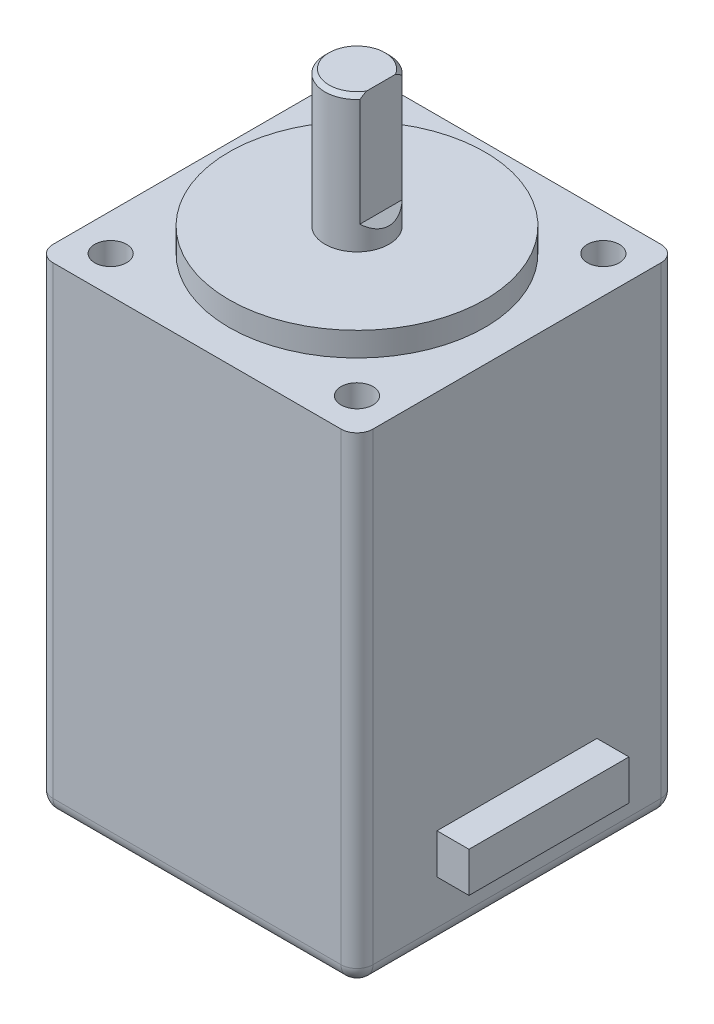
ISO-10303-21;
HEADER;
FILE_DESCRIPTION(('STEP AP214'),'2;1');
FILE_NAME('part.step','',(''),(''),'','','');
FILE_SCHEMA(('AUTOMOTIVE_DESIGN { 1 0 10303 214 1 1 1 1 }'));
ENDSEC;
DATA;
#1=APPLICATION_CONTEXT('core data for automotive mechanical design processes');
#2=APPLICATION_PROTOCOL_DEFINITION('international standard','automotive_design',2000,#1);
#3=PRODUCT_CONTEXT('',#1,'mechanical');
#4=PRODUCT('Part','Part','',(#3));
#5=PRODUCT_RELATED_PRODUCT_CATEGORY('part','',(#4));
#6=PRODUCT_DEFINITION_FORMATION('','',#4);
#7=PRODUCT_DEFINITION_CONTEXT('part definition',#1,'design');
#8=PRODUCT_DEFINITION('design','',#6,#7);
#9=PRODUCT_DEFINITION_SHAPE('','',#8);
#10=(LENGTH_UNIT() NAMED_UNIT(*) SI_UNIT(.MILLI.,.METRE.));
#11=(NAMED_UNIT(*) PLANE_ANGLE_UNIT() SI_UNIT($,.RADIAN.));
#12=(NAMED_UNIT(*) SI_UNIT($,.STERADIAN.) SOLID_ANGLE_UNIT());
#13=UNCERTAINTY_MEASURE_WITH_UNIT(LENGTH_MEASURE(1.E-05),#10,'distance_accuracy_value','');
#14=(GEOMETRIC_REPRESENTATION_CONTEXT(3) GLOBAL_UNCERTAINTY_ASSIGNED_CONTEXT((#13)) GLOBAL_UNIT_ASSIGNED_CONTEXT((#10,
#11,#12)) REPRESENTATION_CONTEXT('',''));
#15=CARTESIAN_POINT('',(0.,0.,0.));
#16=DIRECTION('',(0.,0.,1.));
#17=DIRECTION('',(1.,0.,0.));
#18=AXIS2_PLACEMENT_3D('',#15,#16,#17);
#19=CARTESIAN_POINT('',(9.99999999999998,-30.,9.99999999999995));
#20=DIRECTION('',(1.,0.,0.));
#21=DIRECTION('',(0.,0.,-1.));
#22=AXIS2_PLACEMENT_3D('',#19,#20,#21);
#23=PLANE('',#22);
#24=DIRECTION('',(0.,0.,-1.));
#25=VECTOR('',#24,1.);
#26=CARTESIAN_POINT('',(10.,-29.,-10.));
#27=LINE('',#26,#25);
#28=CARTESIAN_POINT('',(9.99999999999999,-29.,8.99999999999995));
#29=VERTEX_POINT('',#28);
#30=CARTESIAN_POINT('',(10.,-29.,-9.00000000000001));
#31=VERTEX_POINT('',#30);
#32=EDGE_CURVE('E746',#29,#31,#27,.T.);
#33=ORIENTED_EDGE('',*,*,#32,.T.);
#34=DIRECTION('',(0.,1.,0.));
#35=VECTOR('',#34,1.);
#36=CARTESIAN_POINT('',(10.,-30.,-9.00000000000001));
#37=LINE('',#36,#35);
#38=CARTESIAN_POINT('',(10.,0.,-9.00000000000001));
#39=VERTEX_POINT('',#38);
#40=EDGE_CURVE('E748',#31,#39,#37,.T.);
#41=ORIENTED_EDGE('',*,*,#40,.T.);
#42=DIRECTION('',(0.,0.,-1.));
#43=VECTOR('',#42,1.);
#44=CARTESIAN_POINT('',(9.99999999999998,0.,9.99999999999995));
#45=LINE('',#44,#43);
#46=CARTESIAN_POINT('',(9.99999999999999,0.,8.99999999999995));
#47=VERTEX_POINT('',#46);
#48=EDGE_CURVE('E235',#47,#39,#45,.T.);
#49=ORIENTED_EDGE('',*,*,#48,.F.);
#50=DIRECTION('',(0.,1.,0.));
#51=VECTOR('',#50,1.);
#52=CARTESIAN_POINT('',(9.99999999999999,-30.,8.99999999999995));
#53=LINE('',#52,#51);
#54=EDGE_CURVE('E744',#47,#29,#53,.F.);
#55=ORIENTED_EDGE('',*,*,#54,.T.);
#56=EDGE_LOOP('',(#33,#41,#49,#55));
#57=FACE_BOUND('',#56,.T.);
#58=DIRECTION('',(0.,0.,1.));
#59=VECTOR('',#58,1.);
#60=CARTESIAN_POINT('',(9.99999999999998,-26.25,9.99999999999995));
#61=LINE('',#60,#59);
#62=CARTESIAN_POINT('',(10.,-26.25,-5.));
#63=VERTEX_POINT('',#62);
#64=CARTESIAN_POINT('',(10.,-26.25,5.));
#65=VERTEX_POINT('',#64);
#66=EDGE_CURVE('E44',#63,#65,#61,.T.);
#67=ORIENTED_EDGE('',*,*,#66,.T.);
#68=DIRECTION('',(0.,1.,0.));
#69=VECTOR('',#68,1.);
#70=CARTESIAN_POINT('',(10.,-30.,5.));
#71=LINE('',#70,#69);
#72=CARTESIAN_POINT('',(10.,-23.75,5.));
#73=VERTEX_POINT('',#72);
#74=EDGE_CURVE('E12',#65,#73,#71,.T.);
#75=ORIENTED_EDGE('',*,*,#74,.T.);
#76=DIRECTION('',(0.,0.,-1.));
#77=VECTOR('',#76,1.);
#78=CARTESIAN_POINT('',(9.99999999999998,-23.75,9.99999999999996));
#79=LINE('',#78,#77);
#80=CARTESIAN_POINT('',(10.,-23.75,-5.));
#81=VERTEX_POINT('',#80);
#82=EDGE_CURVE('E371',#73,#81,#79,.T.);
#83=ORIENTED_EDGE('',*,*,#82,.T.);
#84=DIRECTION('',(0.,-1.,0.));
#85=VECTOR('',#84,1.);
#86=CARTESIAN_POINT('',(10.,-30.,-5.));
#87=LINE('',#86,#85);
#88=EDGE_CURVE('E160',#81,#63,#87,.T.);
#89=ORIENTED_EDGE('',*,*,#88,.T.);
#90=EDGE_LOOP('',(#67,#75,#83,#89));
#91=FACE_BOUND('',#90,.T.);
#92=ADVANCED_FACE('F36',(#57,#91),#23,.T.);
#93=CARTESIAN_POINT('',(-9.99999999999998,-30.,9.99999999999995));
#94=DIRECTION('',(-1.,0.,0.));
#95=DIRECTION('',(0.,0.,1.));
#96=AXIS2_PLACEMENT_3D('',#93,#94,#95);
#97=PLANE('',#96);
#98=DIRECTION('',(0.,0.,1.));
#99=VECTOR('',#98,1.);
#100=CARTESIAN_POINT('',(-9.99999999999998,0.,9.99999999999995));
#101=LINE('',#100,#99);
#102=CARTESIAN_POINT('',(-9.99999999999996,0.,-9.00000000000001));
#103=VERTEX_POINT('',#102);
#104=CARTESIAN_POINT('',(-9.99999999999998,0.,8.99999999999995));
#105=VERTEX_POINT('',#104);
#106=EDGE_CURVE('E227',#103,#105,#101,.T.);
#107=ORIENTED_EDGE('',*,*,#106,.F.);
#108=DIRECTION('',(0.,1.,0.));
#109=VECTOR('',#108,1.);
#110=CARTESIAN_POINT('',(-9.99999999999996,-30.,-9.00000000000001));
#111=LINE('',#110,#109);
#112=CARTESIAN_POINT('',(-9.99999999999996,-29.,-9.00000000000001));
#113=VERTEX_POINT('',#112);
#114=EDGE_CURVE('E59',#103,#113,#111,.F.);
#115=ORIENTED_EDGE('',*,*,#114,.T.);
#116=DIRECTION('',(0.,0.,1.));
#117=VECTOR('',#116,1.);
#118=CARTESIAN_POINT('',(-9.99999999999998,-29.,9.99999999999995));
#119=LINE('',#118,#117);
#120=CARTESIAN_POINT('',(-9.99999999999998,-29.,8.99999999999995));
#121=VERTEX_POINT('',#120);
#122=EDGE_CURVE('E361',#113,#121,#119,.T.);
#123=ORIENTED_EDGE('',*,*,#122,.T.);
#124=DIRECTION('',(0.,1.,0.));
#125=VECTOR('',#124,1.);
#126=CARTESIAN_POINT('',(-9.99999999999998,-30.,8.99999999999995));
#127=LINE('',#126,#125);
#128=EDGE_CURVE('E350',#121,#105,#127,.T.);
#129=ORIENTED_EDGE('',*,*,#128,.T.);
#130=EDGE_LOOP('',(#107,#115,#123,#129));
#131=FACE_BOUND('',#130,.T.);
#132=ADVANCED_FACE('F339',(#131),#97,.T.);
#133=CARTESIAN_POINT('',(10.,-30.,-10.));
#134=DIRECTION('',(0.,0.,-1.));
#135=DIRECTION('',(-1.,0.,0.));
#136=AXIS2_PLACEMENT_3D('',#133,#134,#135);
#137=PLANE('',#136);
#138=DIRECTION('',(-1.,0.,0.));
#139=VECTOR('',#138,1.);
#140=CARTESIAN_POINT('',(-9.99999999999995,-29.,-10.));
#141=LINE('',#140,#139);
#142=CARTESIAN_POINT('',(9.00000000000003,-29.,-10.));
#143=VERTEX_POINT('',#142);
#144=CARTESIAN_POINT('',(-8.99999999999995,-29.,-10.));
#145=VERTEX_POINT('',#144);
#146=EDGE_CURVE('E752',#143,#145,#141,.T.);
#147=ORIENTED_EDGE('',*,*,#146,.T.);
#148=DIRECTION('',(0.,1.,0.));
#149=VECTOR('',#148,1.);
#150=CARTESIAN_POINT('',(-8.99999999999995,-30.,-10.));
#151=LINE('',#150,#149);
#152=CARTESIAN_POINT('',(-8.99999999999995,0.,-10.));
#153=VERTEX_POINT('',#152);
#154=EDGE_CURVE('E754',#145,#153,#151,.T.);
#155=ORIENTED_EDGE('',*,*,#154,.T.);
#156=DIRECTION('',(-1.,0.,0.));
#157=VECTOR('',#156,1.);
#158=CARTESIAN_POINT('',(10.,0.,-10.));
#159=LINE('',#158,#157);
#160=CARTESIAN_POINT('',(9.00000000000003,0.,-10.));
#161=VERTEX_POINT('',#160);
#162=EDGE_CURVE('E238',#161,#153,#159,.T.);
#163=ORIENTED_EDGE('',*,*,#162,.F.);
#164=DIRECTION('',(0.,1.,0.));
#165=VECTOR('',#164,1.);
#166=CARTESIAN_POINT('',(9.00000000000003,-30.,-10.));
#167=LINE('',#166,#165);
#168=EDGE_CURVE('E750',#161,#143,#167,.F.);
#169=ORIENTED_EDGE('',*,*,#168,.T.);
#170=EDGE_LOOP('',(#147,#155,#163,#169));
#171=FACE_BOUND('',#170,.T.);
#172=ADVANCED_FACE('F336',(#171),#137,.T.);
#173=CARTESIAN_POINT('',(9.99999999999998,-30.,9.99999999999995));
#174=DIRECTION('',(0.,0.,1.));
#175=DIRECTION('',(1.,0.,0.));
#176=AXIS2_PLACEMENT_3D('',#173,#174,#175);
#177=PLANE('',#176);
#178=DIRECTION('',(1.,0.,0.));
#179=VECTOR('',#178,1.);
#180=CARTESIAN_POINT('',(9.99999999999998,-29.,9.99999999999995));
#181=LINE('',#180,#179);
#182=CARTESIAN_POINT('',(-8.99999999999998,-29.,9.99999999999995));
#183=VERTEX_POINT('',#182);
#184=CARTESIAN_POINT('',(8.99999999999999,-29.,9.99999999999995));
#185=VERTEX_POINT('',#184);
#186=EDGE_CURVE('E728',#183,#185,#181,.T.);
#187=ORIENTED_EDGE('',*,*,#186,.T.);
#188=DIRECTION('',(0.,1.,0.));
#189=VECTOR('',#188,1.);
#190=CARTESIAN_POINT('',(8.99999999999999,-30.,9.99999999999995));
#191=LINE('',#190,#189);
#192=CARTESIAN_POINT('',(8.99999999999999,0.,9.99999999999995));
#193=VERTEX_POINT('',#192);
#194=EDGE_CURVE('E733',#185,#193,#191,.T.);
#195=ORIENTED_EDGE('',*,*,#194,.T.);
#196=DIRECTION('',(1.,0.,0.));
#197=VECTOR('',#196,1.);
#198=CARTESIAN_POINT('',(9.99999999999998,0.,9.99999999999995));
#199=LINE('',#198,#197);
#200=CARTESIAN_POINT('',(-8.99999999999998,0.,9.99999999999995));
#201=VERTEX_POINT('',#200);
#202=EDGE_CURVE('E232',#201,#193,#199,.T.);
#203=ORIENTED_EDGE('',*,*,#202,.F.);
#204=DIRECTION('',(0.,1.,0.));
#205=VECTOR('',#204,1.);
#206=CARTESIAN_POINT('',(-8.99999999999998,-30.,9.99999999999995));
#207=LINE('',#206,#205);
#208=EDGE_CURVE('E727',#201,#183,#207,.F.);
#209=ORIENTED_EDGE('',*,*,#208,.T.);
#210=EDGE_LOOP('',(#187,#195,#203,#209));
#211=FACE_BOUND('',#210,.T.);
#212=ADVANCED_FACE('F331',(#211),#177,.T.);
#213=CARTESIAN_POINT('',(0.,-30.,0.));
#214=DIRECTION('',(0.,1.,0.));
#215=DIRECTION('',(0.,0.,1.));
#216=AXIS2_PLACEMENT_3D('',#213,#214,#215);
#217=PLANE('',#216);
#218=DIRECTION('',(0.,0.,-1.));
#219=VECTOR('',#218,1.);
#220=CARTESIAN_POINT('',(8.99999999999998,-30.,9.99999999999995));
#221=LINE('',#220,#219);
#222=CARTESIAN_POINT('',(9.00000000000003,-30.,-9.00000000000001));
#223=VERTEX_POINT('',#222);
#224=CARTESIAN_POINT('',(8.99999999999999,-30.,8.99999999999995));
#225=VERTEX_POINT('',#224);
#226=EDGE_CURVE('E739',#223,#225,#221,.F.);
#227=ORIENTED_EDGE('',*,*,#226,.T.);
#228=DIRECTION('',(1.,0.,0.));
#229=VECTOR('',#228,1.);
#230=CARTESIAN_POINT('',(-9.99999999999998,-30.,8.99999999999995));
#231=LINE('',#230,#229);
#232=CARTESIAN_POINT('',(-8.99999999999998,-30.,8.99999999999995));
#233=VERTEX_POINT('',#232);
#234=EDGE_CURVE('E741',#225,#233,#231,.F.);
#235=ORIENTED_EDGE('',*,*,#234,.T.);
#236=DIRECTION('',(0.,0.,1.));
#237=VECTOR('',#236,1.);
#238=CARTESIAN_POINT('',(-8.99999999999995,-30.,-10.));
#239=LINE('',#238,#237);
#240=CARTESIAN_POINT('',(-8.99999999999995,-30.,-9.00000000000001));
#241=VERTEX_POINT('',#240);
#242=EDGE_CURVE('E735',#233,#241,#239,.F.);
#243=ORIENTED_EDGE('',*,*,#242,.T.);
#244=DIRECTION('',(-1.,0.,0.));
#245=VECTOR('',#244,1.);
#246=CARTESIAN_POINT('',(10.,-30.,-9.00000000000001));
#247=LINE('',#246,#245);
#248=EDGE_CURVE('E737',#241,#223,#247,.F.);
#249=ORIENTED_EDGE('',*,*,#248,.T.);
#250=EDGE_LOOP('',(#227,#235,#243,#249));
#251=FACE_BOUND('',#250,.T.);
#252=ADVANCED_FACE('F328',(#251),#217,.F.);
#253=CARTESIAN_POINT('',(0.,0.,0.));
#254=DIRECTION('',(0.,1.,0.));
#255=DIRECTION('',(0.,0.,1.));
#256=AXIS2_PLACEMENT_3D('',#253,#254,#255);
#257=PLANE('',#256);
#258=CARTESIAN_POINT('',(0.,0.,0.));
#259=DIRECTION('',(0.,1.,0.));
#260=DIRECTION('',(0.,0.,1.));
#261=AXIS2_PLACEMENT_3D('',#258,#259,#260);
#262=CIRCLE('',#261,8.);
#263=CARTESIAN_POINT('',(0.,0.,8.));
#264=VERTEX_POINT('',#263);
#265=EDGE_CURVE('E203',#264,#264,#262,.T.);
#266=ORIENTED_EDGE('',*,*,#265,.F.);
#267=EDGE_LOOP('',(#266));
#268=FACE_BOUND('',#267,.T.);
#269=CARTESIAN_POINT('',(-7.7,0.,7.7));
#270=DIRECTION('',(0.,1.,0.));
#271=DIRECTION('',(0.,0.,1.));
#272=AXIS2_PLACEMENT_3D('',#269,#270,#271);
#273=CIRCLE('',#272,1.);
#274=CARTESIAN_POINT('',(-7.7,0.,8.7));
#275=VERTEX_POINT('',#274);
#276=EDGE_CURVE('E202',#275,#275,#273,.T.);
#277=ORIENTED_EDGE('',*,*,#276,.F.);
#278=EDGE_LOOP('',(#277));
#279=FACE_BOUND('',#278,.T.);
#280=CARTESIAN_POINT('',(7.7,0.,7.7));
#281=DIRECTION('',(0.,1.,0.));
#282=DIRECTION('',(0.,0.,1.));
#283=AXIS2_PLACEMENT_3D('',#280,#281,#282);
#284=CIRCLE('',#283,1.);
#285=CARTESIAN_POINT('',(7.7,0.,8.7));
#286=VERTEX_POINT('',#285);
#287=EDGE_CURVE('E216',#286,#286,#284,.T.);
#288=ORIENTED_EDGE('',*,*,#287,.F.);
#289=EDGE_LOOP('',(#288));
#290=FACE_BOUND('',#289,.T.);
#291=CARTESIAN_POINT('',(7.7,0.,-7.7));
#292=DIRECTION('',(0.,1.,0.));
#293=DIRECTION('',(0.,0.,1.));
#294=AXIS2_PLACEMENT_3D('',#291,#292,#293);
#295=CIRCLE('',#294,0.999999999999999);
#296=CARTESIAN_POINT('',(7.7,0.,-6.7));
#297=VERTEX_POINT('',#296);
#298=EDGE_CURVE('E210',#297,#297,#295,.T.);
#299=ORIENTED_EDGE('',*,*,#298,.F.);
#300=EDGE_LOOP('',(#299));
#301=FACE_BOUND('',#300,.T.);
#302=CARTESIAN_POINT('',(-7.7,0.,-7.7));
#303=DIRECTION('',(0.,1.,0.));
#304=DIRECTION('',(0.,0.,1.));
#305=AXIS2_PLACEMENT_3D('',#302,#303,#304);
#306=CIRCLE('',#305,1.);
#307=CARTESIAN_POINT('',(-7.7,0.,-6.7));
#308=VERTEX_POINT('',#307);
#309=EDGE_CURVE('E209',#308,#308,#306,.T.);
#310=ORIENTED_EDGE('',*,*,#309,.F.);
#311=EDGE_LOOP('',(#310));
#312=FACE_BOUND('',#311,.T.);
#313=ORIENTED_EDGE('',*,*,#162,.T.);
#314=CARTESIAN_POINT('',(-8.99999999999995,0.,-9.00000000000001));
#315=DIRECTION('',(0.,1.,0.));
#316=DIRECTION('',(0.,0.,1.));
#317=AXIS2_PLACEMENT_3D('',#314,#315,#316);
#318=CIRCLE('',#317,1.);
#319=EDGE_CURVE('E356',#153,#103,#318,.T.);
#320=ORIENTED_EDGE('',*,*,#319,.T.);
#321=ORIENTED_EDGE('',*,*,#106,.T.);
#322=CARTESIAN_POINT('',(-8.99999999999998,0.,8.99999999999995));
#323=DIRECTION('',(0.,1.,0.));
#324=DIRECTION('',(0.,0.,1.));
#325=AXIS2_PLACEMENT_3D('',#322,#323,#324);
#326=CIRCLE('',#325,1.);
#327=EDGE_CURVE('E360',#105,#201,#326,.T.);
#328=ORIENTED_EDGE('',*,*,#327,.T.);
#329=ORIENTED_EDGE('',*,*,#202,.T.);
#330=CARTESIAN_POINT('',(8.99999999999999,0.,8.99999999999995));
#331=DIRECTION('',(0.,1.,0.));
#332=DIRECTION('',(0.,0.,1.));
#333=AXIS2_PLACEMENT_3D('',#330,#331,#332);
#334=CIRCLE('',#333,1.);
#335=EDGE_CURVE('E363',#193,#47,#334,.T.);
#336=ORIENTED_EDGE('',*,*,#335,.T.);
#337=ORIENTED_EDGE('',*,*,#48,.T.);
#338=CARTESIAN_POINT('',(9.00000000000003,0.,-9.00000000000001));
#339=DIRECTION('',(0.,1.,0.));
#340=DIRECTION('',(0.,0.,1.));
#341=AXIS2_PLACEMENT_3D('',#338,#339,#340);
#342=CIRCLE('',#341,1.);
#343=EDGE_CURVE('E369',#39,#161,#342,.T.);
#344=ORIENTED_EDGE('',*,*,#343,.T.);
#345=EDGE_LOOP('',(#313,#320,#321,#328,#329,#336,#337,#344));
#346=FACE_BOUND('',#345,.T.);
#347=ADVANCED_FACE('F326',(#268,#279,#290,#301,#312,#346),#257,.T.);
#348=CARTESIAN_POINT('',(-7.7,-2.5,-7.7));
#349=DIRECTION('',(0.,1.,0.));
#350=DIRECTION('',(0.,0.,1.));
#351=AXIS2_PLACEMENT_3D('',#348,#349,#350);
#352=CYLINDRICAL_SURFACE('',#351,1.);
#353=CARTESIAN_POINT('',(-7.7,-2.5,-7.7));
#354=DIRECTION('',(0.,1.,0.));
#355=DIRECTION('',(0.,0.,1.));
#356=AXIS2_PLACEMENT_3D('',#353,#354,#355);
#357=CIRCLE('',#356,1.);
#358=CARTESIAN_POINT('',(-7.7,-2.5,-6.7));
#359=VERTEX_POINT('',#358);
#360=EDGE_CURVE('E224',#359,#359,#357,.T.);
#361=ORIENTED_EDGE('',*,*,#360,.F.);
#362=EDGE_LOOP('',(#361));
#363=FACE_BOUND('',#362,.T.);
#364=ORIENTED_EDGE('',*,*,#309,.T.);
#365=EDGE_LOOP('',(#364));
#366=FACE_BOUND('',#365,.T.);
#367=ADVANCED_FACE('F322',(#363,#366),#352,.F.);
#368=CARTESIAN_POINT('',(-7.7,-2.5,-7.7));
#369=DIRECTION('',(0.,1.,0.));
#370=DIRECTION('',(0.,0.,1.));
#371=AXIS2_PLACEMENT_3D('',#368,#369,#370);
#372=PLANE('',#371);
#373=ORIENTED_EDGE('',*,*,#360,.T.);
#374=EDGE_LOOP('',(#373));
#375=FACE_BOUND('',#374,.T.);
#376=ADVANCED_FACE('F304',(#375),#372,.T.);
#377=CARTESIAN_POINT('',(7.7,-2.5,-7.7));
#378=DIRECTION('',(0.,1.,0.));
#379=DIRECTION('',(0.,0.,1.));
#380=AXIS2_PLACEMENT_3D('',#377,#378,#379);
#381=CYLINDRICAL_SURFACE('',#380,0.999999999999999);
#382=CARTESIAN_POINT('',(7.7,-2.5,-7.7));
#383=DIRECTION('',(0.,1.,0.));
#384=DIRECTION('',(0.,0.,1.));
#385=AXIS2_PLACEMENT_3D('',#382,#383,#384);
#386=CIRCLE('',#385,0.999999999999999);
#387=CARTESIAN_POINT('',(7.7,-2.5,-6.7));
#388=VERTEX_POINT('',#387);
#389=EDGE_CURVE('E206',#388,#388,#386,.T.);
#390=ORIENTED_EDGE('',*,*,#389,.F.);
#391=EDGE_LOOP('',(#390));
#392=FACE_BOUND('',#391,.T.);
#393=ORIENTED_EDGE('',*,*,#298,.T.);
#394=EDGE_LOOP('',(#393));
#395=FACE_BOUND('',#394,.T.);
#396=ADVANCED_FACE('F300',(#392,#395),#381,.F.);
#397=CARTESIAN_POINT('',(7.7,-2.5,-7.7));
#398=DIRECTION('',(0.,1.,0.));
#399=DIRECTION('',(0.,0.,1.));
#400=AXIS2_PLACEMENT_3D('',#397,#398,#399);
#401=PLANE('',#400);
#402=ORIENTED_EDGE('',*,*,#389,.T.);
#403=EDGE_LOOP('',(#402));
#404=FACE_BOUND('',#403,.T.);
#405=ADVANCED_FACE('F296',(#404),#401,.T.);
#406=CARTESIAN_POINT('',(7.7,-2.5,7.7));
#407=DIRECTION('',(0.,1.,0.));
#408=DIRECTION('',(0.,0.,1.));
#409=AXIS2_PLACEMENT_3D('',#406,#407,#408);
#410=CYLINDRICAL_SURFACE('',#409,1.);
#411=CARTESIAN_POINT('',(7.7,-2.5,7.7));
#412=DIRECTION('',(0.,1.,0.));
#413=DIRECTION('',(0.,0.,1.));
#414=AXIS2_PLACEMENT_3D('',#411,#412,#413);
#415=CIRCLE('',#414,1.);
#416=CARTESIAN_POINT('',(7.7,-2.5,8.7));
#417=VERTEX_POINT('',#416);
#418=EDGE_CURVE('E213',#417,#417,#415,.T.);
#419=ORIENTED_EDGE('',*,*,#418,.F.);
#420=EDGE_LOOP('',(#419));
#421=FACE_BOUND('',#420,.T.);
#422=ORIENTED_EDGE('',*,*,#287,.T.);
#423=EDGE_LOOP('',(#422));
#424=FACE_BOUND('',#423,.T.);
#425=ADVANCED_FACE('F299',(#421,#424),#410,.F.);
#426=CARTESIAN_POINT('',(7.7,-2.5,7.7));
#427=DIRECTION('',(0.,1.,0.));
#428=DIRECTION('',(0.,0.,1.));
#429=AXIS2_PLACEMENT_3D('',#426,#427,#428);
#430=PLANE('',#429);
#431=ORIENTED_EDGE('',*,*,#418,.T.);
#432=EDGE_LOOP('',(#431));
#433=FACE_BOUND('',#432,.T.);
#434=ADVANCED_FACE('F306',(#433),#430,.T.);
#435=CARTESIAN_POINT('',(-7.7,-2.5,7.7));
#436=DIRECTION('',(0.,1.,0.));
#437=DIRECTION('',(0.,0.,1.));
#438=AXIS2_PLACEMENT_3D('',#435,#436,#437);
#439=CYLINDRICAL_SURFACE('',#438,1.);
#440=CARTESIAN_POINT('',(-7.7,-2.5,7.7));
#441=DIRECTION('',(0.,1.,0.));
#442=DIRECTION('',(0.,0.,1.));
#443=AXIS2_PLACEMENT_3D('',#440,#441,#442);
#444=CIRCLE('',#443,1.);
#445=CARTESIAN_POINT('',(-7.7,-2.5,8.7));
#446=VERTEX_POINT('',#445);
#447=EDGE_CURVE('E219',#446,#446,#444,.T.);
#448=ORIENTED_EDGE('',*,*,#447,.F.);
#449=EDGE_LOOP('',(#448));
#450=FACE_BOUND('',#449,.T.);
#451=ORIENTED_EDGE('',*,*,#276,.T.);
#452=EDGE_LOOP('',(#451));
#453=FACE_BOUND('',#452,.T.);
#454=ADVANCED_FACE('F309',(#450,#453),#439,.F.);
#455=CARTESIAN_POINT('',(-7.7,-2.5,7.7));
#456=DIRECTION('',(0.,1.,0.));
#457=DIRECTION('',(0.,0.,1.));
#458=AXIS2_PLACEMENT_3D('',#455,#456,#457);
#459=PLANE('',#458);
#460=ORIENTED_EDGE('',*,*,#447,.T.);
#461=EDGE_LOOP('',(#460));
#462=FACE_BOUND('',#461,.T.);
#463=ADVANCED_FACE('F294',(#462),#459,.T.);
#464=CARTESIAN_POINT('',(0.,1.5,0.));
#465=DIRECTION('',(0.,-1.,0.));
#466=DIRECTION('',(0.,0.,-1.));
#467=AXIS2_PLACEMENT_3D('',#464,#465,#466);
#468=CYLINDRICAL_SURFACE('',#467,8.);
#469=CARTESIAN_POINT('',(0.,1.5,0.));
#470=DIRECTION('',(0.,1.,0.));
#471=DIRECTION('',(0.,0.,1.));
#472=AXIS2_PLACEMENT_3D('',#469,#470,#471);
#473=CIRCLE('',#472,8.);
#474=CARTESIAN_POINT('',(0.,1.5,8.));
#475=VERTEX_POINT('',#474);
#476=EDGE_CURVE('E199',#475,#475,#473,.T.);
#477=ORIENTED_EDGE('',*,*,#476,.F.);
#478=EDGE_LOOP('',(#477));
#479=FACE_BOUND('',#478,.T.);
#480=ORIENTED_EDGE('',*,*,#265,.T.);
#481=EDGE_LOOP('',(#480));
#482=FACE_BOUND('',#481,.T.);
#483=ADVANCED_FACE('F290',(#479,#482),#468,.T.);
#484=CARTESIAN_POINT('',(0.,1.5,0.));
#485=DIRECTION('',(0.,1.,0.));
#486=DIRECTION('',(0.,0.,1.));
#487=AXIS2_PLACEMENT_3D('',#484,#485,#486);
#488=PLANE('',#487);
#489=CARTESIAN_POINT('',(0.,1.5,0.));
#490=DIRECTION('',(0.,1.,0.));
#491=DIRECTION('',(0.,0.,1.));
#492=AXIS2_PLACEMENT_3D('',#489,#490,#491);
#493=CIRCLE('',#492,2.);
#494=CARTESIAN_POINT('',(0.,1.5,2.));
#495=VERTEX_POINT('',#494);
#496=EDGE_CURVE('E198',#495,#495,#493,.F.);
#497=ORIENTED_EDGE('',*,*,#496,.T.);
#498=EDGE_LOOP('',(#497));
#499=FACE_BOUND('',#498,.T.);
#500=ORIENTED_EDGE('',*,*,#476,.T.);
#501=EDGE_LOOP('',(#500));
#502=FACE_BOUND('',#501,.T.);
#503=ADVANCED_FACE('F286',(#499,#502),#488,.T.);
#504=CARTESIAN_POINT('',(0.,10.,0.));
#505=DIRECTION('',(0.,-1.,0.));
#506=DIRECTION('',(0.,0.,-1.));
#507=AXIS2_PLACEMENT_3D('',#504,#505,#506);
#508=CYLINDRICAL_SURFACE('',#507,2.);
#509=ORIENTED_EDGE('',*,*,#496,.F.);
#510=EDGE_LOOP('',(#509));
#511=FACE_BOUND('',#510,.T.);
#512=DIRECTION('',(0.,-1.,0.));
#513=VECTOR('',#512,1.);
#514=CARTESIAN_POINT('',(1.5,10.,1.3228756555323));
#515=LINE('',#514,#513);
#516=CARTESIAN_POINT('',(1.5,3.00000000000001,1.32287565553229));
#517=VERTEX_POINT('',#516);
#518=CARTESIAN_POINT('',(1.5,9.75,1.3228756555323));
#519=VERTEX_POINT('',#518);
#520=EDGE_CURVE('E192',#517,#519,#515,.F.);
#521=ORIENTED_EDGE('',*,*,#520,.T.);
#522=CARTESIAN_POINT('',(0.,9.75,0.));
#523=DIRECTION('',(0.,1.,0.));
#524=DIRECTION('',(0.,0.,1.));
#525=AXIS2_PLACEMENT_3D('',#522,#523,#524);
#526=CIRCLE('',#525,2.);
#527=CARTESIAN_POINT('',(1.5,9.75,-1.3228756555323));
#528=VERTEX_POINT('',#527);
#529=EDGE_CURVE('E725',#519,#528,#526,.F.);
#530=ORIENTED_EDGE('',*,*,#529,.T.);
#531=DIRECTION('',(0.,-1.,0.));
#532=VECTOR('',#531,1.);
#533=CARTESIAN_POINT('',(1.5,10.,-1.3228756555323));
#534=LINE('',#533,#532);
#535=CARTESIAN_POINT('',(1.5,3.00000000000001,-1.32287565553229));
#536=VERTEX_POINT('',#535);
#537=EDGE_CURVE('E196',#528,#536,#534,.T.);
#538=ORIENTED_EDGE('',*,*,#537,.T.);
#539=CARTESIAN_POINT('',(0.,4.50000000000002,0.));
#540=DIRECTION('',(-0.707106781186552,-0.707106781186544,0.));
#541=DIRECTION('',(0.707106781186544,-0.707106781186552,0.));
#542=AXIS2_PLACEMENT_3D('',#539,#540,#541);
#543=ELLIPSE('',#542,2.82842712474621,2.);
#544=EDGE_CURVE('E246',#536,#517,#543,.T.);
#545=ORIENTED_EDGE('',*,*,#544,.T.);
#546=EDGE_LOOP('',(#521,#530,#538,#545));
#547=FACE_BOUND('',#546,.T.);
#548=ADVANCED_FACE('F282',(#511,#547),#508,.T.);
#549=CARTESIAN_POINT('',(0.,10.,0.));
#550=DIRECTION('',(0.,1.,0.));
#551=DIRECTION('',(0.,0.,1.));
#552=AXIS2_PLACEMENT_3D('',#549,#550,#551);
#553=PLANE('',#552);
#554=DIRECTION('',(0.,0.,1.));
#555=VECTOR('',#554,1.);
#556=CARTESIAN_POINT('',(1.5,10.,0.));
#557=LINE('',#556,#555);
#558=CARTESIAN_POINT('',(1.5,10.,-0.901387818866));
#559=VERTEX_POINT('',#558);
#560=CARTESIAN_POINT('',(1.5,10.,0.901387818866));
#561=VERTEX_POINT('',#560);
#562=EDGE_CURVE('E241',#559,#561,#557,.T.);
#563=ORIENTED_EDGE('',*,*,#562,.F.);
#564=CARTESIAN_POINT('',(0.,10.,0.));
#565=DIRECTION('',(0.,1.,0.));
#566=DIRECTION('',(0.,0.,1.));
#567=AXIS2_PLACEMENT_3D('',#564,#565,#566);
#568=CIRCLE('',#567,1.75);
#569=EDGE_CURVE('E249',#559,#561,#568,.T.);
#570=ORIENTED_EDGE('',*,*,#569,.T.);
#571=EDGE_LOOP('',(#563,#570));
#572=FACE_BOUND('',#571,.T.);
#573=ADVANCED_FACE('F278',(#572),#553,.T.);
#574=CARTESIAN_POINT('',(1.5,3.00000000000001,-10.));
#575=DIRECTION('',(-0.707106781186552,-0.707106781186544,0.));
#576=DIRECTION('',(0.707106781186544,-0.707106781186552,0.));
#577=AXIS2_PLACEMENT_3D('',#574,#575,#576);
#578=PLANE('',#577);
#579=ORIENTED_EDGE('',*,*,#544,.F.);
#580=DIRECTION('',(0.,0.,1.));
#581=VECTOR('',#580,1.);
#582=CARTESIAN_POINT('',(1.5,3.00000000000001,-10.));
#583=LINE('',#582,#581);
#584=EDGE_CURVE('E189',#536,#517,#583,.T.);
#585=ORIENTED_EDGE('',*,*,#584,.T.);
#586=EDGE_LOOP('',(#579,#585));
#587=FACE_BOUND('',#586,.T.);
#588=ADVANCED_FACE('F275',(#587),#578,.F.);
#589=CARTESIAN_POINT('',(1.5,10.,-10.));
#590=DIRECTION('',(-1.,0.,0.));
#591=DIRECTION('',(0.,-1.,0.));
#592=AXIS2_PLACEMENT_3D('',#589,#590,#591);
#593=PLANE('',#592);
#594=ORIENTED_EDGE('',*,*,#562,.T.);
#595=CARTESIAN_POINT('',(1.5,10.,0.901387818866));
#596=CARTESIAN_POINT('',(1.5,9.981276340262,0.937727475490096));
#597=CARTESIAN_POINT('',(1.5,9.9619077042354,0.973727652597353));
#598=CARTESIAN_POINT('',(1.5,9.92207320091962,1.04508241448855));
#599=CARTESIAN_POINT('',(1.5,9.9016081442816,1.08043745102831));
#600=CARTESIAN_POINT('',(1.5,9.85974884820226,1.15058283973808));
#601=CARTESIAN_POINT('',(1.5,9.83835474960909,1.18537327641368));
#602=CARTESIAN_POINT('',(1.5,9.79475188426179,1.25447596056114));
#603=CARTESIAN_POINT('',(1.5,9.77254253498533,1.28878784094471));
#604=CARTESIAN_POINT('',(1.5,9.75,1.3228756555323));
#605=B_SPLINE_CURVE_WITH_KNOTS('',3,(#595,#596,#597,#598,#599,#600,#601,#602,#603,#604),
.UNSPECIFIED.,.F.,.F.,(4,2,2,2,4),(0.,0.122623332253721,0.245157220205453,0.367672595723045,
0.490277284784263),.UNSPECIFIED.);
#606=EDGE_CURVE('E260',#561,#519,#605,.T.);
#607=ORIENTED_EDGE('',*,*,#606,.T.);
#608=ORIENTED_EDGE('',*,*,#520,.F.);
#609=ORIENTED_EDGE('',*,*,#584,.F.);
#610=ORIENTED_EDGE('',*,*,#537,.F.);
#611=CARTESIAN_POINT('',(1.5,9.75,-1.3228756555323));
#612=CARTESIAN_POINT('',(1.5,9.77254253498533,-1.28878784094471));
#613=CARTESIAN_POINT('',(1.5,9.79475188426179,-1.25447596056114));
#614=CARTESIAN_POINT('',(1.5,9.83835474960909,-1.18537327641368));
#615=CARTESIAN_POINT('',(1.5,9.85974884820226,-1.15058283973808));
#616=CARTESIAN_POINT('',(1.5,9.9016081442816,-1.08043745102831));
#617=CARTESIAN_POINT('',(1.5,9.92207320091962,-1.04508241448855));
#618=CARTESIAN_POINT('',(1.5,9.9619077042354,-0.973727652597353));
#619=CARTESIAN_POINT('',(1.5,9.981276340262,-0.937727475490096));
#620=CARTESIAN_POINT('',(1.5,10.,-0.901387818866));
#621=B_SPLINE_CURVE_WITH_KNOTS('',3,(#611,#612,#613,#614,#615,#616,#617,#618,#619,#620),
.UNSPECIFIED.,.F.,.F.,(4,2,2,2,4),(0.,0.122604689061218,0.24512006457881,0.367653952530542,
0.490277284784263),.UNSPECIFIED.);
#622=EDGE_CURVE('E252',#528,#559,#621,.T.);
#623=ORIENTED_EDGE('',*,*,#622,.T.);
#624=EDGE_LOOP('',(#594,#607,#608,#609,#610,#623));
#625=FACE_BOUND('',#624,.T.);
#626=ADVANCED_FACE('F270',(#625),#593,.F.);
#627=CARTESIAN_POINT('',(0.,10.,0.));
#628=DIRECTION('',(0.,-1.,0.));
#629=DIRECTION('',(0.,0.,-1.));
#630=AXIS2_PLACEMENT_3D('',#627,#628,#629);
#631=CONICAL_SURFACE('',#630,1.75,0.785398163397448);
#632=ORIENTED_EDGE('',*,*,#622,.F.);
#633=ORIENTED_EDGE('',*,*,#529,.F.);
#634=ORIENTED_EDGE('',*,*,#606,.F.);
#635=ORIENTED_EDGE('',*,*,#569,.F.);
#636=EDGE_LOOP('',(#632,#633,#634,#635));
#637=FACE_BOUND('',#636,.T.);
#638=ADVANCED_FACE('F266',(#637),#631,.T.);
#639=CARTESIAN_POINT('',(-8.99999999999995,-30.,-9.00000000000001));
#640=DIRECTION('',(0.,1.,0.));
#641=DIRECTION('',(0.,0.,1.));
#642=AXIS2_PLACEMENT_3D('',#639,#640,#641);
#643=CYLINDRICAL_SURFACE('',#642,1.);
#644=ORIENTED_EDGE('',*,*,#319,.F.);
#645=ORIENTED_EDGE('',*,*,#154,.F.);
#646=CARTESIAN_POINT('',(-8.99999999999996,-29.,-9.00000000000001));
#647=DIRECTION('',(0.,-1.,0.));
#648=DIRECTION('',(0.,0.,-1.));
#649=AXIS2_PLACEMENT_3D('',#646,#647,#648);
#650=CIRCLE('',#649,1.);
#651=EDGE_CURVE('E358',#113,#145,#650,.T.);
#652=ORIENTED_EDGE('',*,*,#651,.F.);
#653=ORIENTED_EDGE('',*,*,#114,.F.);
#654=EDGE_LOOP('',(#644,#645,#652,#653));
#655=FACE_BOUND('',#654,.T.);
#656=ADVANCED_FACE('F38',(#655),#643,.T.);
#657=CARTESIAN_POINT('',(9.00000000000003,-30.,-9.00000000000001));
#658=DIRECTION('',(0.,1.,0.));
#659=DIRECTION('',(0.,0.,1.));
#660=AXIS2_PLACEMENT_3D('',#657,#658,#659);
#661=CYLINDRICAL_SURFACE('',#660,1.);
#662=ORIENTED_EDGE('',*,*,#343,.F.);
#663=ORIENTED_EDGE('',*,*,#40,.F.);
#664=CARTESIAN_POINT('',(9.00000000000003,-29.,-9.00000000000001));
#665=DIRECTION('',(0.,-1.,0.));
#666=DIRECTION('',(0.,0.,-1.));
#667=AXIS2_PLACEMENT_3D('',#664,#665,#666);
#668=CIRCLE('',#667,1.);
#669=EDGE_CURVE('E395',#143,#31,#668,.T.);
#670=ORIENTED_EDGE('',*,*,#669,.F.);
#671=ORIENTED_EDGE('',*,*,#168,.F.);
#672=EDGE_LOOP('',(#662,#663,#670,#671));
#673=FACE_BOUND('',#672,.T.);
#674=ADVANCED_FACE('F550',(#673),#661,.T.);
#675=CARTESIAN_POINT('',(10.,-29.,-9.00000000000001));
#676=DIRECTION('',(1.,0.,0.));
#677=DIRECTION('',(0.,0.,-1.));
#678=AXIS2_PLACEMENT_3D('',#675,#676,#677);
#679=CYLINDRICAL_SURFACE('',#678,1.);
#680=CARTESIAN_POINT('',(-8.99999999999995,-29.,-9.00000000000001));
#681=DIRECTION('',(-1.,0.,0.));
#682=DIRECTION('',(0.,-1.,0.));
#683=AXIS2_PLACEMENT_3D('',#680,#681,#682);
#684=CIRCLE('',#683,1.);
#685=EDGE_CURVE('E193',#145,#241,#684,.T.);
#686=ORIENTED_EDGE('',*,*,#685,.F.);
#687=ORIENTED_EDGE('',*,*,#146,.F.);
#688=CARTESIAN_POINT('',(9.00000000000003,-29.,-9.00000000000001));
#689=DIRECTION('',(1.,0.,0.));
#690=DIRECTION('',(0.,0.,-1.));
#691=AXIS2_PLACEMENT_3D('',#688,#689,#690);
#692=CIRCLE('',#691,1.);
#693=EDGE_CURVE('E392',#223,#143,#692,.T.);
#694=ORIENTED_EDGE('',*,*,#693,.F.);
#695=ORIENTED_EDGE('',*,*,#248,.F.);
#696=EDGE_LOOP('',(#686,#687,#694,#695));
#697=FACE_BOUND('',#696,.T.);
#698=ADVANCED_FACE('F540',(#697),#679,.T.);
#699=CARTESIAN_POINT('',(-8.99999999999995,-29.,-9.00000000000001));
#700=DIRECTION('',(0.,0.,1.));
#701=DIRECTION('',(1.,0.,0.));
#702=AXIS2_PLACEMENT_3D('',#699,#700,#701);
#703=SPHERICAL_SURFACE('',#702,1.);
#704=ORIENTED_EDGE('',*,*,#651,.T.);
#705=ORIENTED_EDGE('',*,*,#685,.T.);
#706=CARTESIAN_POINT('',(-8.99999999999995,-29.,-9.00000000000001));
#707=DIRECTION('',(0.,0.,-1.));
#708=DIRECTION('',(-1.,0.,0.));
#709=AXIS2_PLACEMENT_3D('',#706,#707,#708);
#710=CIRCLE('',#709,1.);
#711=EDGE_CURVE('E389',#113,#241,#710,.F.);
#712=ORIENTED_EDGE('',*,*,#711,.F.);
#713=EDGE_LOOP('',(#704,#705,#712));
#714=FACE_BOUND('',#713,.T.);
#715=ADVANCED_FACE('F530',(#714),#703,.T.);
#716=CARTESIAN_POINT('',(9.00000000000003,-29.,-9.00000000000001));
#717=DIRECTION('',(0.,0.,1.));
#718=DIRECTION('',(1.,0.,0.));
#719=AXIS2_PLACEMENT_3D('',#716,#717,#718);
#720=SPHERICAL_SURFACE('',#719,1.);
#721=ORIENTED_EDGE('',*,*,#693,.T.);
#722=ORIENTED_EDGE('',*,*,#669,.T.);
#723=CARTESIAN_POINT('',(9.00000000000003,-29.,-9.00000000000001));
#724=DIRECTION('',(0.,0.,-1.));
#725=DIRECTION('',(-1.,0.,0.));
#726=AXIS2_PLACEMENT_3D('',#723,#724,#725);
#727=CIRCLE('',#726,1.);
#728=EDGE_CURVE('E386',#223,#31,#727,.F.);
#729=ORIENTED_EDGE('',*,*,#728,.F.);
#730=EDGE_LOOP('',(#721,#722,#729));
#731=FACE_BOUND('',#730,.T.);
#732=ADVANCED_FACE('F520',(#731),#720,.T.);
#733=CARTESIAN_POINT('',(-8.99999999999998,-29.,9.99999999999996));
#734=DIRECTION('',(0.,0.,-1.));
#735=DIRECTION('',(-1.,0.,0.));
#736=AXIS2_PLACEMENT_3D('',#733,#734,#735);
#737=CYLINDRICAL_SURFACE('',#736,1.);
#738=ORIENTED_EDGE('',*,*,#711,.T.);
#739=ORIENTED_EDGE('',*,*,#242,.F.);
#740=CARTESIAN_POINT('',(-8.99999999999998,-29.,8.99999999999995));
#741=DIRECTION('',(0.,0.,1.));
#742=DIRECTION('',(1.,0.,0.));
#743=AXIS2_PLACEMENT_3D('',#740,#741,#742);
#744=CIRCLE('',#743,1.);
#745=EDGE_CURVE('E383',#121,#233,#744,.T.);
#746=ORIENTED_EDGE('',*,*,#745,.F.);
#747=ORIENTED_EDGE('',*,*,#122,.F.);
#748=EDGE_LOOP('',(#738,#739,#746,#747));
#749=FACE_BOUND('',#748,.T.);
#750=ADVANCED_FACE('F510',(#749),#737,.T.);
#751=CARTESIAN_POINT('',(-8.99999999999998,-30.,8.99999999999995));
#752=DIRECTION('',(0.,1.,0.));
#753=DIRECTION('',(0.,0.,1.));
#754=AXIS2_PLACEMENT_3D('',#751,#752,#753);
#755=CYLINDRICAL_SURFACE('',#754,1.);
#756=ORIENTED_EDGE('',*,*,#327,.F.);
#757=ORIENTED_EDGE('',*,*,#128,.F.);
#758=CARTESIAN_POINT('',(-8.99999999999998,-29.,8.99999999999995));
#759=DIRECTION('',(0.,-1.,0.));
#760=DIRECTION('',(0.,0.,-1.));
#761=AXIS2_PLACEMENT_3D('',#758,#759,#760);
#762=CIRCLE('',#761,1.);
#763=EDGE_CURVE('E380',#183,#121,#762,.T.);
#764=ORIENTED_EDGE('',*,*,#763,.F.);
#765=ORIENTED_EDGE('',*,*,#208,.F.);
#766=EDGE_LOOP('',(#756,#757,#764,#765));
#767=FACE_BOUND('',#766,.T.);
#768=ADVANCED_FACE('F500',(#767),#755,.T.);
#769=CARTESIAN_POINT('',(8.99999999999999,-30.,8.99999999999995));
#770=DIRECTION('',(0.,1.,0.));
#771=DIRECTION('',(0.,0.,1.));
#772=AXIS2_PLACEMENT_3D('',#769,#770,#771);
#773=CYLINDRICAL_SURFACE('',#772,1.);
#774=ORIENTED_EDGE('',*,*,#335,.F.);
#775=ORIENTED_EDGE('',*,*,#194,.F.);
#776=CARTESIAN_POINT('',(8.99999999999999,-29.,8.99999999999995));
#777=DIRECTION('',(0.,-1.,0.));
#778=DIRECTION('',(0.,0.,-1.));
#779=AXIS2_PLACEMENT_3D('',#776,#777,#778);
#780=CIRCLE('',#779,1.);
#781=EDGE_CURVE('E377',#29,#185,#780,.T.);
#782=ORIENTED_EDGE('',*,*,#781,.F.);
#783=ORIENTED_EDGE('',*,*,#54,.F.);
#784=EDGE_LOOP('',(#774,#775,#782,#783));
#785=FACE_BOUND('',#784,.T.);
#786=ADVANCED_FACE('F490',(#785),#773,.T.);
#787=CARTESIAN_POINT('',(8.99999999999998,-29.,9.99999999999995));
#788=DIRECTION('',(0.,0.,1.));
#789=DIRECTION('',(1.,0.,0.));
#790=AXIS2_PLACEMENT_3D('',#787,#788,#789);
#791=CYLINDRICAL_SURFACE('',#790,1.);
#792=ORIENTED_EDGE('',*,*,#728,.T.);
#793=ORIENTED_EDGE('',*,*,#32,.F.);
#794=CARTESIAN_POINT('',(8.99999999999999,-29.,8.99999999999995));
#795=DIRECTION('',(0.,0.,1.));
#796=DIRECTION('',(1.,0.,0.));
#797=AXIS2_PLACEMENT_3D('',#794,#795,#796);
#798=CIRCLE('',#797,1.);
#799=EDGE_CURVE('E374',#225,#29,#798,.T.);
#800=ORIENTED_EDGE('',*,*,#799,.F.);
#801=ORIENTED_EDGE('',*,*,#226,.F.);
#802=EDGE_LOOP('',(#792,#793,#800,#801));
#803=FACE_BOUND('',#802,.T.);
#804=ADVANCED_FACE('F480',(#803),#791,.T.);
#805=CARTESIAN_POINT('',(-8.99999999999998,-29.,8.99999999999995));
#806=DIRECTION('',(0.,0.,1.));
#807=DIRECTION('',(1.,0.,0.));
#808=AXIS2_PLACEMENT_3D('',#805,#806,#807);
#809=SPHERICAL_SURFACE('',#808,1.);
#810=ORIENTED_EDGE('',*,*,#763,.T.);
#811=ORIENTED_EDGE('',*,*,#745,.T.);
#812=CARTESIAN_POINT('',(-8.99999999999998,-29.,8.99999999999995));
#813=DIRECTION('',(-1.,0.,0.));
#814=DIRECTION('',(0.,0.,1.));
#815=AXIS2_PLACEMENT_3D('',#812,#813,#814);
#816=CIRCLE('',#815,1.);
#817=EDGE_CURVE('E179',#183,#233,#816,.F.);
#818=ORIENTED_EDGE('',*,*,#817,.F.);
#819=EDGE_LOOP('',(#810,#811,#818));
#820=FACE_BOUND('',#819,.T.);
#821=ADVANCED_FACE('F470',(#820),#809,.T.);
#822=CARTESIAN_POINT('',(8.99999999999999,-29.,8.99999999999995));
#823=DIRECTION('',(0.,0.,1.));
#824=DIRECTION('',(1.,0.,0.));
#825=AXIS2_PLACEMENT_3D('',#822,#823,#824);
#826=SPHERICAL_SURFACE('',#825,1.);
#827=ORIENTED_EDGE('',*,*,#799,.T.);
#828=ORIENTED_EDGE('',*,*,#781,.T.);
#829=CARTESIAN_POINT('',(8.99999999999999,-29.,8.99999999999995));
#830=DIRECTION('',(1.,0.,0.));
#831=DIRECTION('',(0.,0.,-1.));
#832=AXIS2_PLACEMENT_3D('',#829,#830,#831);
#833=CIRCLE('',#832,1.);
#834=EDGE_CURVE('E177',#225,#185,#833,.F.);
#835=ORIENTED_EDGE('',*,*,#834,.F.);
#836=EDGE_LOOP('',(#827,#828,#835));
#837=FACE_BOUND('',#836,.T.);
#838=ADVANCED_FACE('F417',(#837),#826,.T.);
#839=CARTESIAN_POINT('',(9.99999999999998,-29.,8.99999999999995));
#840=DIRECTION('',(-1.,0.,0.));
#841=DIRECTION('',(0.,0.,1.));
#842=AXIS2_PLACEMENT_3D('',#839,#840,#841);
#843=CYLINDRICAL_SURFACE('',#842,1.);
#844=ORIENTED_EDGE('',*,*,#817,.T.);
#845=ORIENTED_EDGE('',*,*,#234,.F.);
#846=ORIENTED_EDGE('',*,*,#834,.T.);
#847=ORIENTED_EDGE('',*,*,#186,.F.);
#848=EDGE_LOOP('',(#844,#845,#846,#847));
#849=FACE_BOUND('',#848,.T.);
#850=ADVANCED_FACE('F410',(#849),#843,.T.);
#851=CARTESIAN_POINT('',(24.3077640640442,-26.25,5.));
#852=DIRECTION('',(0.,0.,-1.));
#853=DIRECTION('',(-1.,0.,0.));
#854=AXIS2_PLACEMENT_3D('',#851,#852,#853);
#855=PLANE('',#854);
#856=ORIENTED_EDGE('',*,*,#74,.F.);
#857=DIRECTION('',(-1.,0.,0.));
#858=VECTOR('',#857,1.);
#859=CARTESIAN_POINT('',(24.3077640640442,-26.25,5.));
#860=LINE('',#859,#858);
#861=CARTESIAN_POINT('',(12.,-26.25,5.));
#862=VERTEX_POINT('',#861);
#863=EDGE_CURVE('E184',#862,#65,#860,.T.);
#864=ORIENTED_EDGE('',*,*,#863,.F.);
#865=DIRECTION('',(0.,-1.,0.));
#866=VECTOR('',#865,1.);
#867=CARTESIAN_POINT('',(12.,-26.25,5.));
#868=LINE('',#867,#866);
#869=CARTESIAN_POINT('',(12.,-23.75,5.));
#870=VERTEX_POINT('',#869);
#871=EDGE_CURVE('E172',#870,#862,#868,.T.);
#872=ORIENTED_EDGE('',*,*,#871,.F.);
#873=DIRECTION('',(-1.,0.,0.));
#874=VECTOR('',#873,1.);
#875=CARTESIAN_POINT('',(24.3077640640442,-23.75,5.));
#876=LINE('',#875,#874);
#877=EDGE_CURVE('E168',#870,#73,#876,.T.);
#878=ORIENTED_EDGE('',*,*,#877,.T.);
#879=EDGE_LOOP('',(#856,#864,#872,#878));
#880=FACE_BOUND('',#879,.T.);
#881=ADVANCED_FACE('F408',(#880),#855,.F.);
#882=CARTESIAN_POINT('',(24.3077640640442,-26.25,-5.));
#883=DIRECTION('',(0.,1.,0.));
#884=DIRECTION('',(0.,0.,1.));
#885=AXIS2_PLACEMENT_3D('',#882,#883,#884);
#886=PLANE('',#885);
#887=ORIENTED_EDGE('',*,*,#66,.F.);
#888=DIRECTION('',(-1.,0.,0.));
#889=VECTOR('',#888,1.);
#890=CARTESIAN_POINT('',(24.3077640640442,-26.25,-5.));
#891=LINE('',#890,#889);
#892=CARTESIAN_POINT('',(12.,-26.25,-5.));
#893=VERTEX_POINT('',#892);
#894=EDGE_CURVE('E163',#893,#63,#891,.T.);
#895=ORIENTED_EDGE('',*,*,#894,.F.);
#896=DIRECTION('',(0.,0.,-1.));
#897=VECTOR('',#896,1.);
#898=CARTESIAN_POINT('',(12.,-26.25,-5.00000000000003));
#899=LINE('',#898,#897);
#900=EDGE_CURVE('E176',#862,#893,#899,.T.);
#901=ORIENTED_EDGE('',*,*,#900,.F.);
#902=ORIENTED_EDGE('',*,*,#863,.T.);
#903=EDGE_LOOP('',(#887,#895,#901,#902));
#904=FACE_BOUND('',#903,.T.);
#905=ADVANCED_FACE('F405',(#904),#886,.F.);
#906=CARTESIAN_POINT('',(24.3077640640442,-26.25,-5.));
#907=DIRECTION('',(0.,0.,1.));
#908=DIRECTION('',(1.,0.,0.));
#909=AXIS2_PLACEMENT_3D('',#906,#907,#908);
#910=PLANE('',#909);
#911=ORIENTED_EDGE('',*,*,#88,.F.);
#912=DIRECTION('',(-1.,0.,0.));
#913=VECTOR('',#912,1.);
#914=CARTESIAN_POINT('',(24.3077640640442,-23.75,-5.));
#915=LINE('',#914,#913);
#916=CARTESIAN_POINT('',(12.,-23.75,-5.));
#917=VERTEX_POINT('',#916);
#918=EDGE_CURVE('E51',#917,#81,#915,.T.);
#919=ORIENTED_EDGE('',*,*,#918,.F.);
#920=DIRECTION('',(0.,1.,0.));
#921=VECTOR('',#920,1.);
#922=CARTESIAN_POINT('',(12.,-26.25,-5.));
#923=LINE('',#922,#921);
#924=EDGE_CURVE('E157',#893,#917,#923,.T.);
#925=ORIENTED_EDGE('',*,*,#924,.F.);
#926=ORIENTED_EDGE('',*,*,#894,.T.);
#927=EDGE_LOOP('',(#911,#919,#925,#926));
#928=FACE_BOUND('',#927,.T.);
#929=ADVANCED_FACE('F154',(#928),#910,.F.);
#930=CARTESIAN_POINT('',(24.3077640640442,-23.75,-5.));
#931=DIRECTION('',(0.,-1.,0.));
#932=DIRECTION('',(0.,0.,-1.));
#933=AXIS2_PLACEMENT_3D('',#930,#931,#932);
#934=PLANE('',#933);
#935=ORIENTED_EDGE('',*,*,#82,.F.);
#936=ORIENTED_EDGE('',*,*,#877,.F.);
#937=DIRECTION('',(0.,0.,1.));
#938=VECTOR('',#937,1.);
#939=CARTESIAN_POINT('',(12.,-23.75,-5.00000000000003));
#940=LINE('',#939,#938);
#941=EDGE_CURVE('E162',#917,#870,#940,.T.);
#942=ORIENTED_EDGE('',*,*,#941,.F.);
#943=ORIENTED_EDGE('',*,*,#918,.T.);
#944=EDGE_LOOP('',(#935,#936,#942,#943));
#945=FACE_BOUND('',#944,.T.);
#946=ADVANCED_FACE('F166',(#945),#934,.F.);
#947=CARTESIAN_POINT('',(12.,-30.,9.99999999999996));
#948=DIRECTION('',(1.,0.,0.));
#949=DIRECTION('',(0.,0.,-1.));
#950=AXIS2_PLACEMENT_3D('',#947,#948,#949);
#951=PLANE('',#950);
#952=ORIENTED_EDGE('',*,*,#941,.T.);
#953=ORIENTED_EDGE('',*,*,#871,.T.);
#954=ORIENTED_EDGE('',*,*,#900,.T.);
#955=ORIENTED_EDGE('',*,*,#924,.T.);
#956=EDGE_LOOP('',(#952,#953,#954,#955));
#957=FACE_BOUND('',#956,.T.);
#958=ADVANCED_FACE('F175',(#957),#951,.T.);
#959=CLOSED_SHELL('',(#92,#132,#172,#212,#252,#347,#367,#376,#396,#405,#425,#434,#454,#463,#483,
#503,#548,#573,#588,#626,#638,#656,#674,#698,#715,#732,#750,#768,#786,#804,#821,#838,#850,#881,
#905,#929,#946,#958));
#960=MANIFOLD_SOLID_BREP('B2',#959);
#961=ADVANCED_BREP_SHAPE_REPRESENTATION('',(#18,#960),#14);
#962=SHAPE_DEFINITION_REPRESENTATION(#9,#961);
ENDSEC;
END-ISO-10303-21;
